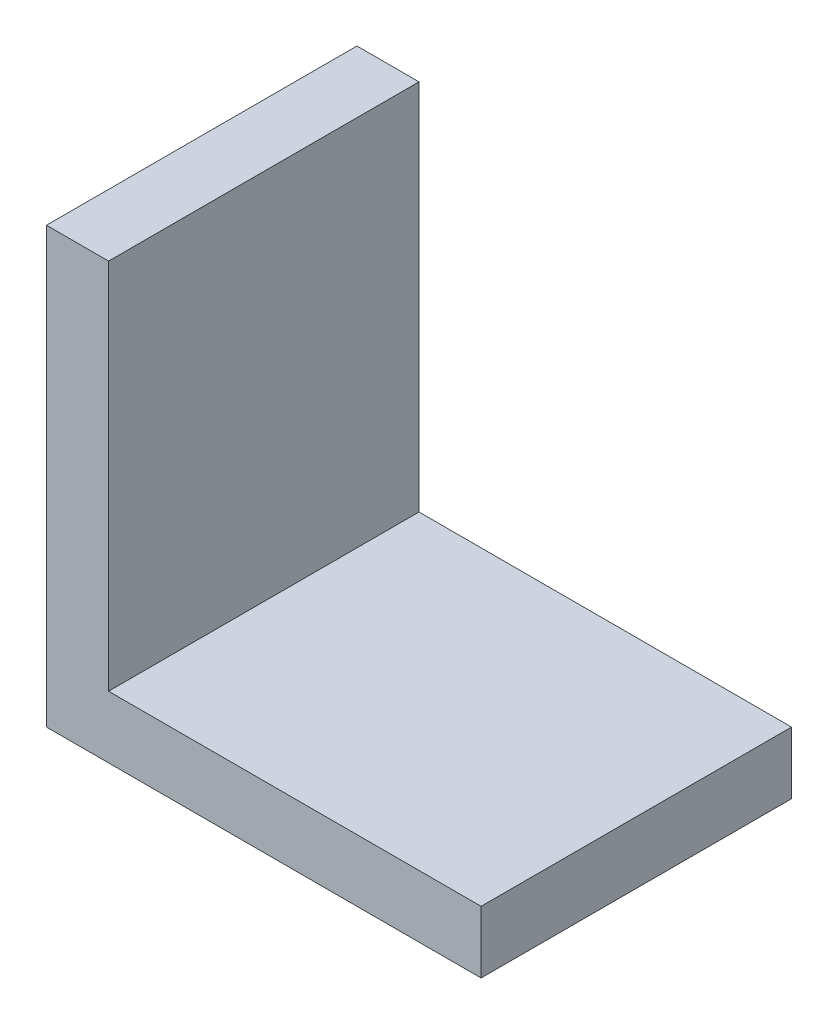
ISO-10303-21;
HEADER;
FILE_DESCRIPTION(('STEP AP214'),'2;1');
FILE_NAME('part.step','',(''),(''),'','','');
FILE_SCHEMA(('AUTOMOTIVE_DESIGN { 1 0 10303 214 1 1 1 1 }'));
ENDSEC;
DATA;
#1=APPLICATION_CONTEXT('core data for automotive mechanical design processes');
#2=APPLICATION_PROTOCOL_DEFINITION('international standard','automotive_design',2000,#1);
#3=PRODUCT_CONTEXT('',#1,'mechanical');
#4=PRODUCT('Part','Part','',(#3));
#5=PRODUCT_RELATED_PRODUCT_CATEGORY('part','',(#4));
#6=PRODUCT_DEFINITION_FORMATION('','',#4);
#7=PRODUCT_DEFINITION_CONTEXT('part definition',#1,'design');
#8=PRODUCT_DEFINITION('design','',#6,#7);
#9=PRODUCT_DEFINITION_SHAPE('','',#8);
#10=(LENGTH_UNIT() NAMED_UNIT(*) SI_UNIT(.MILLI.,.METRE.));
#11=(NAMED_UNIT(*) PLANE_ANGLE_UNIT() SI_UNIT($,.RADIAN.));
#12=(NAMED_UNIT(*) SI_UNIT($,.STERADIAN.) SOLID_ANGLE_UNIT());
#13=UNCERTAINTY_MEASURE_WITH_UNIT(LENGTH_MEASURE(1.E-05),#10,'distance_accuracy_value','');
#14=(GEOMETRIC_REPRESENTATION_CONTEXT(3) GLOBAL_UNCERTAINTY_ASSIGNED_CONTEXT((#13)) GLOBAL_UNIT_ASSIGNED_CONTEXT((#10,
#11,#12)) REPRESENTATION_CONTEXT('',''));
#15=CARTESIAN_POINT('',(0.,0.,0.));
#16=DIRECTION('',(0.,0.,1.));
#17=DIRECTION('',(1.,0.,0.));
#18=AXIS2_PLACEMENT_3D('',#15,#16,#17);
#19=CARTESIAN_POINT('',(28.,0.,20.));
#20=DIRECTION('',(0.,1.,0.));
#21=DIRECTION('',(-1.,0.,0.));
#22=AXIS2_PLACEMENT_3D('',#19,#20,#21);
#23=PLANE('',#22);
#24=CARTESIAN_POINT('',(14.,0.,10.));
#25=DIRECTION('',(0.,1.,0.));
#26=DIRECTION('',(-1.,0.,0.));
#27=AXIS2_PLACEMENT_3D('',#24,#25,#26);
#28=CIRCLE('',#27,2.5);
#29=CARTESIAN_POINT('',(11.5,0.,10.));
#30=VERTEX_POINT('',#29);
#31=EDGE_CURVE('E11',#30,#30,#28,.F.);
#32=ORIENTED_EDGE('',*,*,#31,.F.);
#33=EDGE_LOOP('',(#32));
#34=FACE_BOUND('',#33,.T.);
#35=DIRECTION('',(1.,0.,0.));
#36=VECTOR('',#35,1.);
#37=CARTESIAN_POINT('',(28.,0.,0.));
#38=LINE('',#37,#36);
#39=CARTESIAN_POINT('',(0.,0.,0.));
#40=VERTEX_POINT('',#39);
#41=CARTESIAN_POINT('',(28.,0.,0.));
#42=VERTEX_POINT('',#41);
#43=EDGE_CURVE('E135',#40,#42,#38,.T.);
#44=ORIENTED_EDGE('',*,*,#43,.T.);
#45=DIRECTION('',(0.,0.,-1.));
#46=VECTOR('',#45,1.);
#47=CARTESIAN_POINT('',(28.,0.,20.));
#48=LINE('',#47,#46);
#49=CARTESIAN_POINT('',(28.,0.,20.));
#50=VERTEX_POINT('',#49);
#51=EDGE_CURVE('E163',#50,#42,#48,.T.);
#52=ORIENTED_EDGE('',*,*,#51,.F.);
#53=DIRECTION('',(1.,0.,0.));
#54=VECTOR('',#53,1.);
#55=CARTESIAN_POINT('',(28.,0.,20.));
#56=LINE('',#55,#54);
#57=CARTESIAN_POINT('',(0.,0.,20.));
#58=VERTEX_POINT('',#57);
#59=EDGE_CURVE('E152',#58,#50,#56,.T.);
#60=ORIENTED_EDGE('',*,*,#59,.F.);
#61=DIRECTION('',(0.,0.,-1.));
#62=VECTOR('',#61,1.);
#63=CARTESIAN_POINT('',(0.,0.,20.));
#64=LINE('',#63,#62);
#65=EDGE_CURVE('E131',#58,#40,#64,.T.);
#66=ORIENTED_EDGE('',*,*,#65,.T.);
#67=EDGE_LOOP('',(#44,#52,#60,#66));
#68=FACE_BOUND('',#67,.T.);
#69=ADVANCED_FACE('F45',(#34,#68),#23,.F.);
#70=CARTESIAN_POINT('',(28.,4.,20.));
#71=DIRECTION('',(-1.,0.,0.));
#72=DIRECTION('',(0.,0.,1.));
#73=AXIS2_PLACEMENT_3D('',#70,#71,#72);
#74=PLANE('',#73);
#75=DIRECTION('',(0.,1.,0.));
#76=VECTOR('',#75,1.);
#77=CARTESIAN_POINT('',(28.,4.,0.));
#78=LINE('',#77,#76);
#79=CARTESIAN_POINT('',(28.,4.,0.));
#80=VERTEX_POINT('',#79);
#81=EDGE_CURVE('E139',#42,#80,#78,.T.);
#82=ORIENTED_EDGE('',*,*,#81,.T.);
#83=DIRECTION('',(0.,0.,-1.));
#84=VECTOR('',#83,1.);
#85=CARTESIAN_POINT('',(28.,4.,20.));
#86=LINE('',#85,#84);
#87=CARTESIAN_POINT('',(28.,4.,20.));
#88=VERTEX_POINT('',#87);
#89=EDGE_CURVE('E159',#88,#80,#86,.T.);
#90=ORIENTED_EDGE('',*,*,#89,.F.);
#91=DIRECTION('',(0.,1.,0.));
#92=VECTOR('',#91,1.);
#93=CARTESIAN_POINT('',(28.,4.,20.));
#94=LINE('',#93,#92);
#95=EDGE_CURVE('E100',#50,#88,#94,.T.);
#96=ORIENTED_EDGE('',*,*,#95,.F.);
#97=ORIENTED_EDGE('',*,*,#51,.T.);
#98=EDGE_LOOP('',(#82,#90,#96,#97));
#99=FACE_BOUND('',#98,.T.);
#100=ADVANCED_FACE('F185',(#99),#74,.F.);
#101=CARTESIAN_POINT('',(4.,4.,20.));
#102=DIRECTION('',(0.,-1.,0.));
#103=DIRECTION('',(1.,0.,0.));
#104=AXIS2_PLACEMENT_3D('',#101,#102,#103);
#105=PLANE('',#104);
#106=DIRECTION('',(-1.,0.,0.));
#107=VECTOR('',#106,1.);
#108=CARTESIAN_POINT('',(4.,4.,0.));
#109=LINE('',#108,#107);
#110=CARTESIAN_POINT('',(4.,4.,0.));
#111=VERTEX_POINT('',#110);
#112=EDGE_CURVE('E143',#80,#111,#109,.T.);
#113=ORIENTED_EDGE('',*,*,#112,.T.);
#114=DIRECTION('',(0.,0.,-1.));
#115=VECTOR('',#114,1.);
#116=CARTESIAN_POINT('',(4.,4.,20.));
#117=LINE('',#116,#115);
#118=CARTESIAN_POINT('',(4.,4.,20.));
#119=VERTEX_POINT('',#118);
#120=EDGE_CURVE('E124',#119,#111,#117,.T.);
#121=ORIENTED_EDGE('',*,*,#120,.F.);
#122=DIRECTION('',(-1.,0.,0.));
#123=VECTOR('',#122,1.);
#124=CARTESIAN_POINT('',(4.,4.,20.));
#125=LINE('',#124,#123);
#126=EDGE_CURVE('E113',#88,#119,#125,.T.);
#127=ORIENTED_EDGE('',*,*,#126,.F.);
#128=ORIENTED_EDGE('',*,*,#89,.T.);
#129=EDGE_LOOP('',(#113,#121,#127,#128));
#130=FACE_BOUND('',#129,.T.);
#131=ADVANCED_FACE('F192',(#130),#105,.F.);
#132=CARTESIAN_POINT('',(4.,28.,20.));
#133=DIRECTION('',(-1.,0.,0.));
#134=DIRECTION('',(0.,-1.,0.));
#135=AXIS2_PLACEMENT_3D('',#132,#133,#134);
#136=PLANE('',#135);
#137=DIRECTION('',(0.,1.,0.));
#138=VECTOR('',#137,1.);
#139=CARTESIAN_POINT('',(4.,28.,0.));
#140=LINE('',#139,#138);
#141=CARTESIAN_POINT('',(4.,28.,0.));
#142=VERTEX_POINT('',#141);
#143=EDGE_CURVE('E122',#111,#142,#140,.T.);
#144=ORIENTED_EDGE('',*,*,#143,.T.);
#145=DIRECTION('',(0.,0.,-1.));
#146=VECTOR('',#145,1.);
#147=CARTESIAN_POINT('',(4.,28.,20.));
#148=LINE('',#147,#146);
#149=CARTESIAN_POINT('',(4.,28.,20.));
#150=VERTEX_POINT('',#149);
#151=EDGE_CURVE('E119',#150,#142,#148,.T.);
#152=ORIENTED_EDGE('',*,*,#151,.F.);
#153=DIRECTION('',(0.,1.,0.));
#154=VECTOR('',#153,1.);
#155=CARTESIAN_POINT('',(4.,28.,20.));
#156=LINE('',#155,#154);
#157=EDGE_CURVE('E107',#119,#150,#156,.T.);
#158=ORIENTED_EDGE('',*,*,#157,.F.);
#159=ORIENTED_EDGE('',*,*,#120,.T.);
#160=EDGE_LOOP('',(#144,#152,#158,#159));
#161=FACE_BOUND('',#160,.T.);
#162=ADVANCED_FACE('F120',(#161),#136,.F.);
#163=CARTESIAN_POINT('',(0.,28.,20.));
#164=DIRECTION('',(0.,-1.,0.));
#165=DIRECTION('',(0.,0.,-1.));
#166=AXIS2_PLACEMENT_3D('',#163,#164,#165);
#167=PLANE('',#166);
#168=DIRECTION('',(-1.,0.,0.));
#169=VECTOR('',#168,1.);
#170=CARTESIAN_POINT('',(0.,28.,0.));
#171=LINE('',#170,#169);
#172=CARTESIAN_POINT('',(0.,28.,0.));
#173=VERTEX_POINT('',#172);
#174=EDGE_CURVE('E85',#142,#173,#171,.T.);
#175=ORIENTED_EDGE('',*,*,#174,.T.);
#176=DIRECTION('',(0.,0.,-1.));
#177=VECTOR('',#176,1.);
#178=CARTESIAN_POINT('',(0.,28.,20.));
#179=LINE('',#178,#177);
#180=CARTESIAN_POINT('',(0.,28.,20.));
#181=VERTEX_POINT('',#180);
#182=EDGE_CURVE('E125',#181,#173,#179,.T.);
#183=ORIENTED_EDGE('',*,*,#182,.F.);
#184=DIRECTION('',(-1.,0.,0.));
#185=VECTOR('',#184,1.);
#186=CARTESIAN_POINT('',(0.,28.,20.));
#187=LINE('',#186,#185);
#188=EDGE_CURVE('E111',#150,#181,#187,.T.);
#189=ORIENTED_EDGE('',*,*,#188,.F.);
#190=ORIENTED_EDGE('',*,*,#151,.T.);
#191=EDGE_LOOP('',(#175,#183,#189,#190));
#192=FACE_BOUND('',#191,.T.);
#193=ADVANCED_FACE('F127',(#192),#167,.F.);
#194=CARTESIAN_POINT('',(0.,0.,20.));
#195=DIRECTION('',(1.,0.,0.));
#196=DIRECTION('',(0.,0.,-1.));
#197=AXIS2_PLACEMENT_3D('',#194,#195,#196);
#198=PLANE('',#197);
#199=CARTESIAN_POINT('',(0.,14.,10.));
#200=DIRECTION('',(1.,0.,0.));
#201=DIRECTION('',(0.,0.,-1.));
#202=AXIS2_PLACEMENT_3D('',#199,#200,#201);
#203=CIRCLE('',#202,2.5);
#204=CARTESIAN_POINT('',(0.,14.,7.5));
#205=VERTEX_POINT('',#204);
#206=EDGE_CURVE('E54',#205,#205,#203,.F.);
#207=ORIENTED_EDGE('',*,*,#206,.F.);
#208=EDGE_LOOP('',(#207));
#209=FACE_BOUND('',#208,.T.);
#210=DIRECTION('',(0.,-1.,0.));
#211=VECTOR('',#210,1.);
#212=CARTESIAN_POINT('',(0.,0.,0.));
#213=LINE('',#212,#211);
#214=EDGE_CURVE('E91',#173,#40,#213,.T.);
#215=ORIENTED_EDGE('',*,*,#214,.T.);
#216=ORIENTED_EDGE('',*,*,#65,.F.);
#217=DIRECTION('',(0.,-1.,0.));
#218=VECTOR('',#217,1.);
#219=CARTESIAN_POINT('',(0.,0.,20.));
#220=LINE('',#219,#218);
#221=EDGE_CURVE('E62',#181,#58,#220,.T.);
#222=ORIENTED_EDGE('',*,*,#221,.F.);
#223=ORIENTED_EDGE('',*,*,#182,.T.);
#224=EDGE_LOOP('',(#215,#216,#222,#223));
#225=FACE_BOUND('',#224,.T.);
#226=ADVANCED_FACE('F171',(#209,#225),#198,.F.);
#227=CARTESIAN_POINT('',(0.,0.,20.));
#228=DIRECTION('',(0.,0.,-1.));
#229=DIRECTION('',(-1.,0.,0.));
#230=AXIS2_PLACEMENT_3D('',#227,#228,#229);
#231=PLANE('',#230);
#232=ORIENTED_EDGE('',*,*,#59,.T.);
#233=ORIENTED_EDGE('',*,*,#95,.T.);
#234=ORIENTED_EDGE('',*,*,#126,.T.);
#235=ORIENTED_EDGE('',*,*,#157,.T.);
#236=ORIENTED_EDGE('',*,*,#188,.T.);
#237=ORIENTED_EDGE('',*,*,#221,.T.);
#238=EDGE_LOOP('',(#232,#233,#234,#235,#236,#237));
#239=FACE_BOUND('',#238,.T.);
#240=ADVANCED_FACE('F109',(#239),#231,.F.);
#241=CARTESIAN_POINT('',(0.,0.,0.));
#242=DIRECTION('',(0.,0.,-1.));
#243=DIRECTION('',(-1.,0.,0.));
#244=AXIS2_PLACEMENT_3D('',#241,#242,#243);
#245=PLANE('',#244);
#246=ORIENTED_EDGE('',*,*,#43,.F.);
#247=ORIENTED_EDGE('',*,*,#214,.F.);
#248=ORIENTED_EDGE('',*,*,#174,.F.);
#249=ORIENTED_EDGE('',*,*,#143,.F.);
#250=ORIENTED_EDGE('',*,*,#112,.F.);
#251=ORIENTED_EDGE('',*,*,#81,.F.);
#252=EDGE_LOOP('',(#246,#247,#248,#249,#250,#251));
#253=FACE_BOUND('',#252,.T.);
#254=ADVANCED_FACE('F179',(#253),#245,.T.);
#255=CARTESIAN_POINT('',(-6.4,14.,10.));
#256=DIRECTION('',(1.,0.,0.));
#257=DIRECTION('',(0.,0.,-1.));
#258=AXIS2_PLACEMENT_3D('',#255,#256,#257);
#259=CYLINDRICAL_SURFACE('',#258,2.5);
#260=CARTESIAN_POINT('',(-6.4,14.,10.));
#261=DIRECTION('',(-1.,0.,0.));
#262=DIRECTION('',(0.,0.,1.));
#263=AXIS2_PLACEMENT_3D('',#260,#261,#262);
#264=CIRCLE('',#263,2.5);
#265=CARTESIAN_POINT('',(-6.4,14.,12.5));
#266=VERTEX_POINT('',#265);
#267=EDGE_CURVE('E140',#266,#266,#264,.T.);
#268=ORIENTED_EDGE('',*,*,#267,.F.);
#269=EDGE_LOOP('',(#268));
#270=FACE_BOUND('',#269,.T.);
#271=ORIENTED_EDGE('',*,*,#206,.T.);
#272=EDGE_LOOP('',(#271));
#273=FACE_BOUND('',#272,.T.);
#274=ADVANCED_FACE('F169',(#270,#273),#259,.T.);
#275=CARTESIAN_POINT('',(-6.4,14.,10.));
#276=DIRECTION('',(-1.,0.,0.));
#277=DIRECTION('',(0.,0.,1.));
#278=AXIS2_PLACEMENT_3D('',#275,#276,#277);
#279=PLANE('',#278);
#280=ORIENTED_EDGE('',*,*,#267,.T.);
#281=EDGE_LOOP('',(#280));
#282=FACE_BOUND('',#281,.T.);
#283=ADVANCED_FACE('F219',(#282),#279,.T.);
#284=CARTESIAN_POINT('',(14.,-6.4,10.));
#285=DIRECTION('',(0.,1.,0.));
#286=DIRECTION('',(-1.,0.,0.));
#287=AXIS2_PLACEMENT_3D('',#284,#285,#286);
#288=CYLINDRICAL_SURFACE('',#287,2.5);
#289=CARTESIAN_POINT('',(14.,-6.4,10.));
#290=DIRECTION('',(0.,-1.,0.));
#291=DIRECTION('',(1.,0.,0.));
#292=AXIS2_PLACEMENT_3D('',#289,#290,#291);
#293=CIRCLE('',#292,2.5);
#294=CARTESIAN_POINT('',(16.5,-6.4,10.));
#295=VERTEX_POINT('',#294);
#296=EDGE_CURVE('E210',#295,#295,#293,.T.);
#297=ORIENTED_EDGE('',*,*,#296,.F.);
#298=EDGE_LOOP('',(#297));
#299=FACE_BOUND('',#298,.T.);
#300=ORIENTED_EDGE('',*,*,#31,.T.);
#301=EDGE_LOOP('',(#300));
#302=FACE_BOUND('',#301,.T.);
#303=ADVANCED_FACE('F217',(#299,#302),#288,.T.);
#304=CARTESIAN_POINT('',(14.,-6.4,10.));
#305=DIRECTION('',(0.,-1.,0.));
#306=DIRECTION('',(1.,0.,0.));
#307=AXIS2_PLACEMENT_3D('',#304,#305,#306);
#308=PLANE('',#307);
#309=ORIENTED_EDGE('',*,*,#296,.T.);
#310=EDGE_LOOP('',(#309));
#311=FACE_BOUND('',#310,.T.);
#312=ADVANCED_FACE('F215',(#311),#308,.T.);
#313=CLOSED_SHELL('',(#69,#100,#131,#162,#193,#226,#240,#254,#274,#283,#303,#312));
#314=MANIFOLD_SOLID_BREP('B2',#313);
#315=ADVANCED_BREP_SHAPE_REPRESENTATION('',(#18,#314),#14);
#316=SHAPE_DEFINITION_REPRESENTATION(#9,#315);
ENDSEC;
END-ISO-10303-21;
